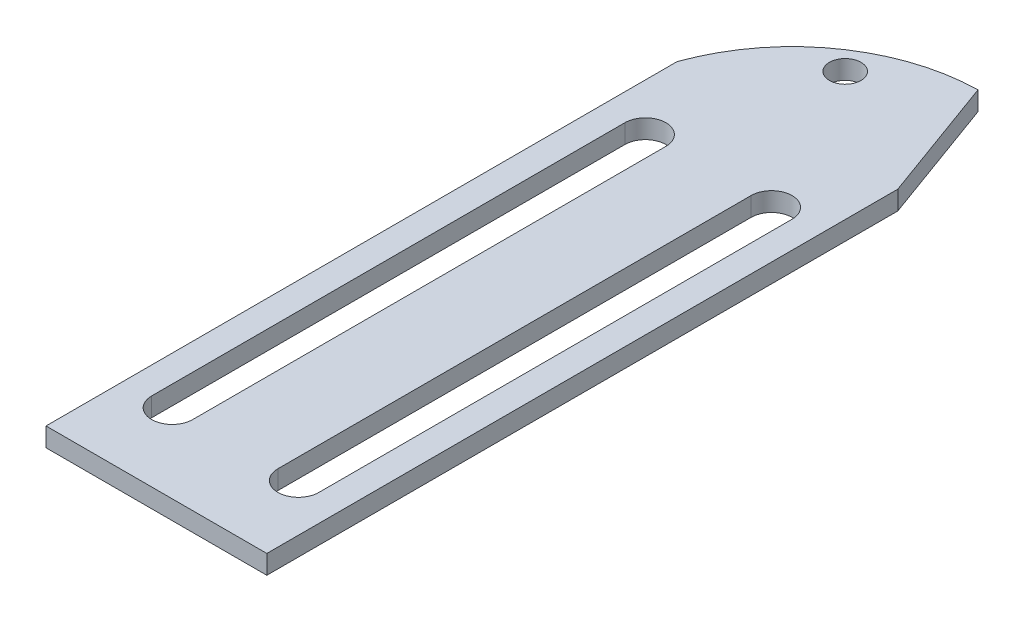
ISO-10303-21;
HEADER;
FILE_DESCRIPTION(('STEP AP214'),'2;1');
FILE_NAME('part.step','',(''),(''),'','','');
FILE_SCHEMA(('AUTOMOTIVE_DESIGN { 1 0 10303 214 1 1 1 1 }'));
ENDSEC;
DATA;
#1=APPLICATION_CONTEXT('core data for automotive mechanical design processes');
#2=APPLICATION_PROTOCOL_DEFINITION('international standard','automotive_design',2000,#1);
#3=PRODUCT_CONTEXT('',#1,'mechanical');
#4=PRODUCT('Part','Part','',(#3));
#5=PRODUCT_RELATED_PRODUCT_CATEGORY('part','',(#4));
#6=PRODUCT_DEFINITION_FORMATION('','',#4);
#7=PRODUCT_DEFINITION_CONTEXT('part definition',#1,'design');
#8=PRODUCT_DEFINITION('design','',#6,#7);
#9=PRODUCT_DEFINITION_SHAPE('','',#8);
#10=(LENGTH_UNIT() NAMED_UNIT(*) SI_UNIT(.MILLI.,.METRE.));
#11=(NAMED_UNIT(*) PLANE_ANGLE_UNIT() SI_UNIT($,.RADIAN.));
#12=(NAMED_UNIT(*) SI_UNIT($,.STERADIAN.) SOLID_ANGLE_UNIT());
#13=UNCERTAINTY_MEASURE_WITH_UNIT(LENGTH_MEASURE(1.E-05),#10,'distance_accuracy_value','');
#14=(GEOMETRIC_REPRESENTATION_CONTEXT(3) GLOBAL_UNCERTAINTY_ASSIGNED_CONTEXT((#13)) GLOBAL_UNIT_ASSIGNED_CONTEXT((#10,
#11,#12)) REPRESENTATION_CONTEXT('',''));
#15=CARTESIAN_POINT('',(0.,0.,0.));
#16=DIRECTION('',(0.,0.,1.));
#17=DIRECTION('',(1.,0.,0.));
#18=AXIS2_PLACEMENT_3D('',#15,#16,#17);
#19=CARTESIAN_POINT('',(17.5,3.,0.));
#20=DIRECTION('',(1.,0.,0.));
#21=DIRECTION('',(0.,0.,-1.));
#22=AXIS2_PLACEMENT_3D('',#19,#20,#21);
#23=PLANE('',#22);
#24=DIRECTION('',(0.,0.,1.));
#25=VECTOR('',#24,1.);
#26=CARTESIAN_POINT('',(17.5,0.,0.));
#27=LINE('',#26,#25);
#28=CARTESIAN_POINT('',(17.5,0.,-50.));
#29=VERTEX_POINT('',#28);
#30=CARTESIAN_POINT('',(17.5,0.,50.));
#31=VERTEX_POINT('',#30);
#32=EDGE_CURVE('E170',#29,#31,#27,.T.);
#33=ORIENTED_EDGE('',*,*,#32,.F.);
#34=DIRECTION('',(0.,-1.,0.));
#35=VECTOR('',#34,1.);
#36=CARTESIAN_POINT('',(17.5,3.,-50.));
#37=LINE('',#36,#35);
#38=CARTESIAN_POINT('',(17.5,3.,-50.));
#39=VERTEX_POINT('',#38);
#40=EDGE_CURVE('E236',#39,#29,#37,.T.);
#41=ORIENTED_EDGE('',*,*,#40,.F.);
#42=DIRECTION('',(0.,0.,1.));
#43=VECTOR('',#42,1.);
#44=CARTESIAN_POINT('',(17.5,3.,0.));
#45=LINE('',#44,#43);
#46=CARTESIAN_POINT('',(17.5,3.,50.));
#47=VERTEX_POINT('',#46);
#48=EDGE_CURVE('E204',#39,#47,#45,.T.);
#49=ORIENTED_EDGE('',*,*,#48,.T.);
#50=DIRECTION('',(0.,-1.,0.));
#51=VECTOR('',#50,1.);
#52=CARTESIAN_POINT('',(17.5,3.,50.));
#53=LINE('',#52,#51);
#54=EDGE_CURVE('E217',#47,#31,#53,.T.);
#55=ORIENTED_EDGE('',*,*,#54,.T.);
#56=EDGE_LOOP('',(#33,#41,#49,#55));
#57=FACE_BOUND('',#56,.T.);
#58=ADVANCED_FACE('F35',(#57),#23,.T.);
#59=CARTESIAN_POINT('',(31.5225791194544,3.,-11.4732805067825));
#60=DIRECTION('',(-0.93969262078591,0.,0.342020143325663));
#61=DIRECTION('',(0.342020143325663,0.,0.939692620785911));
#62=AXIS2_PLACEMENT_3D('',#59,#60,#61);
#63=PLANE('',#62);
#64=DIRECTION('',(-0.342020143325663,0.,-0.939692620785911));
#65=VECTOR('',#64,1.);
#66=CARTESIAN_POINT('',(31.5225791194544,0.,-11.4732805067825));
#67=LINE('',#66,#65);
#68=CARTESIAN_POINT('',(10.2225098197638,0.,-69.9947399405021));
#69=VERTEX_POINT('',#68);
#70=EDGE_CURVE('E220',#29,#69,#67,.T.);
#71=ORIENTED_EDGE('',*,*,#70,.T.);
#72=DIRECTION('',(0.,1.,0.));
#73=VECTOR('',#72,1.);
#74=CARTESIAN_POINT('',(10.2225098197638,1.5,-69.9947399405021));
#75=LINE('',#74,#73);
#76=CARTESIAN_POINT('',(10.2225098197638,3.,-69.9947399405021));
#77=VERTEX_POINT('',#76);
#78=EDGE_CURVE('E43',#69,#77,#75,.T.);
#79=ORIENTED_EDGE('',*,*,#78,.T.);
#80=DIRECTION('',(-0.342020143325663,0.,-0.939692620785911));
#81=VECTOR('',#80,1.);
#82=CARTESIAN_POINT('',(31.5225791194544,3.,-11.4732805067825));
#83=LINE('',#82,#81);
#84=EDGE_CURVE('E207',#39,#77,#83,.T.);
#85=ORIENTED_EDGE('',*,*,#84,.F.);
#86=ORIENTED_EDGE('',*,*,#40,.T.);
#87=EDGE_LOOP('',(#71,#79,#85,#86));
#88=FACE_BOUND('',#87,.T.);
#89=ADVANCED_FACE('F238',(#88),#63,.F.);
#90=CARTESIAN_POINT('',(-17.5,3.,0.));
#91=DIRECTION('',(1.,0.,0.));
#92=DIRECTION('',(0.,0.,-1.));
#93=AXIS2_PLACEMENT_3D('',#90,#91,#92);
#94=PLANE('',#93);
#95=DIRECTION('',(0.,0.,1.));
#96=VECTOR('',#95,1.);
#97=CARTESIAN_POINT('',(-17.5,0.,0.));
#98=LINE('',#97,#96);
#99=CARTESIAN_POINT('',(-17.5,0.,-50.));
#100=VERTEX_POINT('',#99);
#101=CARTESIAN_POINT('',(-17.5,0.,50.));
#102=VERTEX_POINT('',#101);
#103=EDGE_CURVE('E222',#100,#102,#98,.T.);
#104=ORIENTED_EDGE('',*,*,#103,.T.);
#105=DIRECTION('',(0.,-1.,0.));
#106=VECTOR('',#105,1.);
#107=CARTESIAN_POINT('',(-17.5,3.,50.));
#108=LINE('',#107,#106);
#109=CARTESIAN_POINT('',(-17.5,3.,50.));
#110=VERTEX_POINT('',#109);
#111=EDGE_CURVE('E230',#110,#102,#108,.T.);
#112=ORIENTED_EDGE('',*,*,#111,.F.);
#113=DIRECTION('',(0.,0.,1.));
#114=VECTOR('',#113,1.);
#115=CARTESIAN_POINT('',(-17.5,3.,0.));
#116=LINE('',#115,#114);
#117=CARTESIAN_POINT('',(-17.5,3.,-50.));
#118=VERTEX_POINT('',#117);
#119=EDGE_CURVE('E210',#118,#110,#116,.T.);
#120=ORIENTED_EDGE('',*,*,#119,.F.);
#121=DIRECTION('',(0.,-1.,0.));
#122=VECTOR('',#121,1.);
#123=CARTESIAN_POINT('',(-17.5,3.,-50.));
#124=LINE('',#123,#122);
#125=EDGE_CURVE('E233',#118,#100,#124,.T.);
#126=ORIENTED_EDGE('',*,*,#125,.T.);
#127=EDGE_LOOP('',(#104,#112,#120,#126));
#128=FACE_BOUND('',#127,.T.);
#129=ADVANCED_FACE('F250',(#128),#94,.F.);
#130=CARTESIAN_POINT('',(0.,3.,50.));
#131=DIRECTION('',(0.,0.,-1.));
#132=DIRECTION('',(-1.,0.,0.));
#133=AXIS2_PLACEMENT_3D('',#130,#131,#132);
#134=PLANE('',#133);
#135=DIRECTION('',(1.,0.,0.));
#136=VECTOR('',#135,1.);
#137=CARTESIAN_POINT('',(0.,0.,50.));
#138=LINE('',#137,#136);
#139=EDGE_CURVE('E224',#102,#31,#138,.T.);
#140=ORIENTED_EDGE('',*,*,#139,.T.);
#141=ORIENTED_EDGE('',*,*,#54,.F.);
#142=DIRECTION('',(1.,0.,0.));
#143=VECTOR('',#142,1.);
#144=CARTESIAN_POINT('',(0.,3.,50.));
#145=LINE('',#144,#143);
#146=EDGE_CURVE('E212',#110,#47,#145,.T.);
#147=ORIENTED_EDGE('',*,*,#146,.F.);
#148=ORIENTED_EDGE('',*,*,#111,.T.);
#149=EDGE_LOOP('',(#140,#141,#147,#148));
#150=FACE_BOUND('',#149,.T.);
#151=ADVANCED_FACE('F247',(#150),#134,.F.);
#152=CARTESIAN_POINT('',(-2.83030939833299,3.,-62.));
#153=DIRECTION('',(0.,-1.,0.));
#154=DIRECTION('',(0.,0.,-1.));
#155=AXIS2_PLACEMENT_3D('',#152,#153,#154);
#156=CYLINDRICAL_SURFACE('',#155,2.5);
#157=CARTESIAN_POINT('',(-2.83030939833299,3.,-62.));
#158=DIRECTION('',(0.,1.,0.));
#159=DIRECTION('',(0.,0.,1.));
#160=AXIS2_PLACEMENT_3D('',#157,#158,#159);
#161=CIRCLE('',#160,2.5);
#162=CARTESIAN_POINT('',(-2.83030939833299,3.,-59.5));
#163=VERTEX_POINT('',#162);
#164=EDGE_CURVE('E214',#163,#163,#161,.T.);
#165=ORIENTED_EDGE('',*,*,#164,.T.);
#166=EDGE_LOOP('',(#165));
#167=FACE_BOUND('',#166,.T.);
#168=CARTESIAN_POINT('',(-2.83030939833299,0.,-62.));
#169=DIRECTION('',(0.,1.,0.));
#170=DIRECTION('',(0.,0.,1.));
#171=AXIS2_PLACEMENT_3D('',#168,#169,#170);
#172=CIRCLE('',#171,2.5);
#173=CARTESIAN_POINT('',(-2.83030939833299,0.,-59.5));
#174=VERTEX_POINT('',#173);
#175=EDGE_CURVE('E208',#174,#174,#172,.T.);
#176=ORIENTED_EDGE('',*,*,#175,.F.);
#177=EDGE_LOOP('',(#176));
#178=FACE_BOUND('',#177,.T.);
#179=ADVANCED_FACE('F259',(#167,#178),#156,.F.);
#180=CARTESIAN_POINT('',(0.,3.,0.));
#181=DIRECTION('',(0.,1.,0.));
#182=DIRECTION('',(0.,0.,1.));
#183=AXIS2_PLACEMENT_3D('',#180,#181,#182);
#184=PLANE('',#183);
#185=CARTESIAN_POINT('',(-10.,3.,37.5));
#186=DIRECTION('',(0.,1.,0.));
#187=DIRECTION('',(0.,0.,1.));
#188=AXIS2_PLACEMENT_3D('',#185,#186,#187);
#189=CIRCLE('',#188,3.25);
#190=CARTESIAN_POINT('',(-13.25,3.,37.5));
#191=VERTEX_POINT('',#190);
#192=CARTESIAN_POINT('',(-6.75,3.,37.5));
#193=VERTEX_POINT('',#192);
#194=EDGE_CURVE('E137',#191,#193,#189,.T.);
#195=ORIENTED_EDGE('',*,*,#194,.F.);
#196=DIRECTION('',(0.,0.,-1.));
#197=VECTOR('',#196,1.);
#198=CARTESIAN_POINT('',(-13.25,3.,37.5));
#199=LINE('',#198,#197);
#200=CARTESIAN_POINT('',(-13.25,3.,-37.5));
#201=VERTEX_POINT('',#200);
#202=EDGE_CURVE('E154',#191,#201,#199,.T.);
#203=ORIENTED_EDGE('',*,*,#202,.T.);
#204=CARTESIAN_POINT('',(-10.,3.,-37.5));
#205=DIRECTION('',(0.,1.,0.));
#206=DIRECTION('',(0.,0.,1.));
#207=AXIS2_PLACEMENT_3D('',#204,#205,#206);
#208=CIRCLE('',#207,3.25);
#209=CARTESIAN_POINT('',(-6.75000000000002,3.,-37.5));
#210=VERTEX_POINT('',#209);
#211=EDGE_CURVE('E157',#210,#201,#208,.T.);
#212=ORIENTED_EDGE('',*,*,#211,.F.);
#213=DIRECTION('',(0.,0.,-1.));
#214=VECTOR('',#213,1.);
#215=CARTESIAN_POINT('',(-6.75,3.,37.5));
#216=LINE('',#215,#214);
#217=EDGE_CURVE('E163',#193,#210,#216,.T.);
#218=ORIENTED_EDGE('',*,*,#217,.F.);
#219=EDGE_LOOP('',(#195,#203,#212,#218));
#220=FACE_BOUND('',#219,.T.);
#221=CARTESIAN_POINT('',(10.,3.,37.5));
#222=DIRECTION('',(0.,1.,0.));
#223=DIRECTION('',(0.,0.,1.));
#224=AXIS2_PLACEMENT_3D('',#221,#222,#223);
#225=CIRCLE('',#224,3.25);
#226=CARTESIAN_POINT('',(6.75000000000002,3.,37.5));
#227=VERTEX_POINT('',#226);
#228=CARTESIAN_POINT('',(13.25,3.,37.5));
#229=VERTEX_POINT('',#228);
#230=EDGE_CURVE('E164',#227,#229,#225,.T.);
#231=ORIENTED_EDGE('',*,*,#230,.F.);
#232=DIRECTION('',(0.,0.,-1.));
#233=VECTOR('',#232,1.);
#234=CARTESIAN_POINT('',(6.75000000000002,3.,37.5));
#235=LINE('',#234,#233);
#236=CARTESIAN_POINT('',(6.75,3.,-37.5));
#237=VERTEX_POINT('',#236);
#238=EDGE_CURVE('E184',#227,#237,#235,.T.);
#239=ORIENTED_EDGE('',*,*,#238,.T.);
#240=CARTESIAN_POINT('',(10.,3.,-37.5));
#241=DIRECTION('',(0.,1.,0.));
#242=DIRECTION('',(0.,0.,1.));
#243=AXIS2_PLACEMENT_3D('',#240,#241,#242);
#244=CIRCLE('',#243,3.25);
#245=CARTESIAN_POINT('',(13.25,3.,-37.5));
#246=VERTEX_POINT('',#245);
#247=EDGE_CURVE('E187',#246,#237,#244,.T.);
#248=ORIENTED_EDGE('',*,*,#247,.F.);
#249=DIRECTION('',(0.,0.,-1.));
#250=VECTOR('',#249,1.);
#251=CARTESIAN_POINT('',(13.25,3.,37.5));
#252=LINE('',#251,#250);
#253=EDGE_CURVE('E191',#229,#246,#252,.T.);
#254=ORIENTED_EDGE('',*,*,#253,.F.);
#255=EDGE_LOOP('',(#231,#239,#248,#254));
#256=FACE_BOUND('',#255,.T.);
#257=ORIENTED_EDGE('',*,*,#84,.T.);
#258=CARTESIAN_POINT('',(10.7842712474619,3.,-40.));
#259=DIRECTION('',(0.,1.,0.));
#260=DIRECTION('',(0.,0.,1.));
#261=AXIS2_PLACEMENT_3D('',#258,#259,#260);
#262=CIRCLE('',#261,30.);
#263=EDGE_CURVE('E11',#77,#118,#262,.T.);
#264=ORIENTED_EDGE('',*,*,#263,.T.);
#265=ORIENTED_EDGE('',*,*,#119,.T.);
#266=ORIENTED_EDGE('',*,*,#146,.T.);
#267=ORIENTED_EDGE('',*,*,#48,.F.);
#268=EDGE_LOOP('',(#257,#264,#265,#266,#267));
#269=FACE_BOUND('',#268,.T.);
#270=ORIENTED_EDGE('',*,*,#164,.F.);
#271=EDGE_LOOP('',(#270));
#272=FACE_BOUND('',#271,.T.);
#273=ADVANCED_FACE('F256',(#220,#256,#269,#272),#184,.T.);
#274=CARTESIAN_POINT('',(0.,0.,0.));
#275=DIRECTION('',(0.,1.,0.));
#276=DIRECTION('',(0.,0.,1.));
#277=AXIS2_PLACEMENT_3D('',#274,#275,#276);
#278=PLANE('',#277);
#279=DIRECTION('',(0.,0.,-1.));
#280=VECTOR('',#279,1.);
#281=CARTESIAN_POINT('',(-13.25,0.,37.5));
#282=LINE('',#281,#280);
#283=CARTESIAN_POINT('',(-13.25,0.,37.5));
#284=VERTEX_POINT('',#283);
#285=CARTESIAN_POINT('',(-13.25,0.,-37.5));
#286=VERTEX_POINT('',#285);
#287=EDGE_CURVE('E142',#284,#286,#282,.T.);
#288=ORIENTED_EDGE('',*,*,#287,.F.);
#289=CARTESIAN_POINT('',(-10.,0.,37.5));
#290=DIRECTION('',(0.,1.,0.));
#291=DIRECTION('',(0.,0.,1.));
#292=AXIS2_PLACEMENT_3D('',#289,#290,#291);
#293=CIRCLE('',#292,3.25);
#294=CARTESIAN_POINT('',(-6.75,0.,37.5));
#295=VERTEX_POINT('',#294);
#296=EDGE_CURVE('E134',#284,#295,#293,.T.);
#297=ORIENTED_EDGE('',*,*,#296,.T.);
#298=DIRECTION('',(0.,0.,-1.));
#299=VECTOR('',#298,1.);
#300=CARTESIAN_POINT('',(-6.75,0.,37.5));
#301=LINE('',#300,#299);
#302=CARTESIAN_POINT('',(-6.75000000000002,0.,-37.5));
#303=VERTEX_POINT('',#302);
#304=EDGE_CURVE('E146',#295,#303,#301,.T.);
#305=ORIENTED_EDGE('',*,*,#304,.T.);
#306=CARTESIAN_POINT('',(-10.,0.,-37.5));
#307=DIRECTION('',(0.,1.,0.));
#308=DIRECTION('',(0.,0.,1.));
#309=AXIS2_PLACEMENT_3D('',#306,#307,#308);
#310=CIRCLE('',#309,3.25);
#311=EDGE_CURVE('E150',#303,#286,#310,.T.);
#312=ORIENTED_EDGE('',*,*,#311,.T.);
#313=EDGE_LOOP('',(#288,#297,#305,#312));
#314=FACE_BOUND('',#313,.T.);
#315=DIRECTION('',(0.,0.,-1.));
#316=VECTOR('',#315,1.);
#317=CARTESIAN_POINT('',(6.75000000000002,0.,37.5));
#318=LINE('',#317,#316);
#319=CARTESIAN_POINT('',(6.75000000000002,0.,37.5));
#320=VERTEX_POINT('',#319);
#321=CARTESIAN_POINT('',(6.75,0.,-37.5));
#322=VERTEX_POINT('',#321);
#323=EDGE_CURVE('E177',#320,#322,#318,.T.);
#324=ORIENTED_EDGE('',*,*,#323,.F.);
#325=CARTESIAN_POINT('',(10.,0.,37.5));
#326=DIRECTION('',(0.,1.,0.));
#327=DIRECTION('',(0.,0.,1.));
#328=AXIS2_PLACEMENT_3D('',#325,#326,#327);
#329=CIRCLE('',#328,3.25);
#330=CARTESIAN_POINT('',(13.25,0.,37.5));
#331=VERTEX_POINT('',#330);
#332=EDGE_CURVE('E188',#320,#331,#329,.T.);
#333=ORIENTED_EDGE('',*,*,#332,.T.);
#334=DIRECTION('',(0.,0.,-1.));
#335=VECTOR('',#334,1.);
#336=CARTESIAN_POINT('',(13.25,0.,37.5));
#337=LINE('',#336,#335);
#338=CARTESIAN_POINT('',(13.25,0.,-37.5));
#339=VERTEX_POINT('',#338);
#340=EDGE_CURVE('E199',#331,#339,#337,.T.);
#341=ORIENTED_EDGE('',*,*,#340,.T.);
#342=CARTESIAN_POINT('',(10.,0.,-37.5));
#343=DIRECTION('',(0.,1.,0.));
#344=DIRECTION('',(0.,0.,1.));
#345=AXIS2_PLACEMENT_3D('',#342,#343,#344);
#346=CIRCLE('',#345,3.25);
#347=EDGE_CURVE('E196',#339,#322,#346,.T.);
#348=ORIENTED_EDGE('',*,*,#347,.T.);
#349=EDGE_LOOP('',(#324,#333,#341,#348));
#350=FACE_BOUND('',#349,.T.);
#351=ORIENTED_EDGE('',*,*,#103,.F.);
#352=CARTESIAN_POINT('',(10.7842712474619,0.,-40.));
#353=DIRECTION('',(0.,1.,0.));
#354=DIRECTION('',(0.,0.,1.));
#355=AXIS2_PLACEMENT_3D('',#352,#353,#354);
#356=CIRCLE('',#355,30.);
#357=EDGE_CURVE('E57',#100,#69,#356,.F.);
#358=ORIENTED_EDGE('',*,*,#357,.T.);
#359=ORIENTED_EDGE('',*,*,#70,.F.);
#360=ORIENTED_EDGE('',*,*,#32,.T.);
#361=ORIENTED_EDGE('',*,*,#139,.F.);
#362=EDGE_LOOP('',(#351,#358,#359,#360,#361));
#363=FACE_BOUND('',#362,.T.);
#364=ORIENTED_EDGE('',*,*,#175,.T.);
#365=EDGE_LOOP('',(#364));
#366=FACE_BOUND('',#365,.T.);
#367=ADVANCED_FACE('F152',(#314,#350,#363,#366),#278,.F.);
#368=CARTESIAN_POINT('',(10.,0.,37.5));
#369=DIRECTION('',(0.,1.,0.));
#370=DIRECTION('',(0.,0.,1.));
#371=AXIS2_PLACEMENT_3D('',#368,#369,#370);
#372=CYLINDRICAL_SURFACE('',#371,3.25);
#373=ORIENTED_EDGE('',*,*,#230,.T.);
#374=DIRECTION('',(0.,1.,0.));
#375=VECTOR('',#374,1.);
#376=CARTESIAN_POINT('',(13.25,0.,37.5));
#377=LINE('',#376,#375);
#378=EDGE_CURVE('E174',#331,#229,#377,.T.);
#379=ORIENTED_EDGE('',*,*,#378,.F.);
#380=ORIENTED_EDGE('',*,*,#332,.F.);
#381=DIRECTION('',(0.,1.,0.));
#382=VECTOR('',#381,1.);
#383=CARTESIAN_POINT('',(6.75000000000002,0.,37.5));
#384=LINE('',#383,#382);
#385=EDGE_CURVE('E182',#320,#227,#384,.T.);
#386=ORIENTED_EDGE('',*,*,#385,.T.);
#387=EDGE_LOOP('',(#373,#379,#380,#386));
#388=FACE_BOUND('',#387,.T.);
#389=ADVANCED_FACE('F269',(#388),#372,.F.);
#390=CARTESIAN_POINT('',(6.75000000000002,0.,37.5));
#391=DIRECTION('',(1.,0.,0.));
#392=DIRECTION('',(0.,0.,-1.));
#393=AXIS2_PLACEMENT_3D('',#390,#391,#392);
#394=PLANE('',#393);
#395=ORIENTED_EDGE('',*,*,#238,.F.);
#396=ORIENTED_EDGE('',*,*,#385,.F.);
#397=ORIENTED_EDGE('',*,*,#323,.T.);
#398=DIRECTION('',(0.,1.,0.));
#399=VECTOR('',#398,1.);
#400=CARTESIAN_POINT('',(6.75,0.,-37.5));
#401=LINE('',#400,#399);
#402=EDGE_CURVE('E180',#322,#237,#401,.T.);
#403=ORIENTED_EDGE('',*,*,#402,.T.);
#404=EDGE_LOOP('',(#395,#396,#397,#403));
#405=FACE_BOUND('',#404,.T.);
#406=ADVANCED_FACE('F275',(#405),#394,.T.);
#407=CARTESIAN_POINT('',(10.,0.,-37.5));
#408=DIRECTION('',(0.,1.,0.));
#409=DIRECTION('',(0.,0.,1.));
#410=AXIS2_PLACEMENT_3D('',#407,#408,#409);
#411=CYLINDRICAL_SURFACE('',#410,3.25);
#412=ORIENTED_EDGE('',*,*,#247,.T.);
#413=ORIENTED_EDGE('',*,*,#402,.F.);
#414=ORIENTED_EDGE('',*,*,#347,.F.);
#415=DIRECTION('',(0.,1.,0.));
#416=VECTOR('',#415,1.);
#417=CARTESIAN_POINT('',(13.25,0.,-37.5));
#418=LINE('',#417,#416);
#419=EDGE_CURVE('E178',#339,#246,#418,.T.);
#420=ORIENTED_EDGE('',*,*,#419,.T.);
#421=EDGE_LOOP('',(#412,#413,#414,#420));
#422=FACE_BOUND('',#421,.T.);
#423=ADVANCED_FACE('F319',(#422),#411,.F.);
#424=CARTESIAN_POINT('',(13.25,0.,37.5));
#425=DIRECTION('',(1.,0.,0.));
#426=DIRECTION('',(0.,0.,-1.));
#427=AXIS2_PLACEMENT_3D('',#424,#425,#426);
#428=PLANE('',#427);
#429=ORIENTED_EDGE('',*,*,#253,.T.);
#430=ORIENTED_EDGE('',*,*,#419,.F.);
#431=ORIENTED_EDGE('',*,*,#340,.F.);
#432=ORIENTED_EDGE('',*,*,#378,.T.);
#433=EDGE_LOOP('',(#429,#430,#431,#432));
#434=FACE_BOUND('',#433,.T.);
#435=ADVANCED_FACE('F327',(#434),#428,.F.);
#436=CARTESIAN_POINT('',(-10.,0.,37.5));
#437=DIRECTION('',(0.,1.,0.));
#438=DIRECTION('',(0.,0.,1.));
#439=AXIS2_PLACEMENT_3D('',#436,#437,#438);
#440=CYLINDRICAL_SURFACE('',#439,3.25);
#441=ORIENTED_EDGE('',*,*,#194,.T.);
#442=DIRECTION('',(0.,1.,0.));
#443=VECTOR('',#442,1.);
#444=CARTESIAN_POINT('',(-6.75,0.,37.5));
#445=LINE('',#444,#443);
#446=EDGE_CURVE('E130',#295,#193,#445,.T.);
#447=ORIENTED_EDGE('',*,*,#446,.F.);
#448=ORIENTED_EDGE('',*,*,#296,.F.);
#449=DIRECTION('',(0.,1.,0.));
#450=VECTOR('',#449,1.);
#451=CARTESIAN_POINT('',(-13.25,0.,37.5));
#452=LINE('',#451,#450);
#453=EDGE_CURVE('E168',#284,#191,#452,.T.);
#454=ORIENTED_EDGE('',*,*,#453,.T.);
#455=EDGE_LOOP('',(#441,#447,#448,#454));
#456=FACE_BOUND('',#455,.T.);
#457=ADVANCED_FACE('F132',(#456),#440,.F.);
#458=CARTESIAN_POINT('',(-13.25,0.,37.5));
#459=DIRECTION('',(1.,0.,0.));
#460=DIRECTION('',(0.,0.,-1.));
#461=AXIS2_PLACEMENT_3D('',#458,#459,#460);
#462=PLANE('',#461);
#463=ORIENTED_EDGE('',*,*,#202,.F.);
#464=ORIENTED_EDGE('',*,*,#453,.F.);
#465=ORIENTED_EDGE('',*,*,#287,.T.);
#466=DIRECTION('',(0.,1.,0.));
#467=VECTOR('',#466,1.);
#468=CARTESIAN_POINT('',(-13.25,0.,-37.5));
#469=LINE('',#468,#467);
#470=EDGE_CURVE('E171',#286,#201,#469,.T.);
#471=ORIENTED_EDGE('',*,*,#470,.T.);
#472=EDGE_LOOP('',(#463,#464,#465,#471));
#473=FACE_BOUND('',#472,.T.);
#474=ADVANCED_FACE('F342',(#473),#462,.T.);
#475=CARTESIAN_POINT('',(-10.,0.,-37.5));
#476=DIRECTION('',(0.,1.,0.));
#477=DIRECTION('',(0.,0.,1.));
#478=AXIS2_PLACEMENT_3D('',#475,#476,#477);
#479=CYLINDRICAL_SURFACE('',#478,3.25);
#480=ORIENTED_EDGE('',*,*,#211,.T.);
#481=ORIENTED_EDGE('',*,*,#470,.F.);
#482=ORIENTED_EDGE('',*,*,#311,.F.);
#483=DIRECTION('',(0.,1.,0.));
#484=VECTOR('',#483,1.);
#485=CARTESIAN_POINT('',(-6.75000000000002,0.,-37.5));
#486=LINE('',#485,#484);
#487=EDGE_CURVE('E141',#303,#210,#486,.T.);
#488=ORIENTED_EDGE('',*,*,#487,.T.);
#489=EDGE_LOOP('',(#480,#481,#482,#488));
#490=FACE_BOUND('',#489,.T.);
#491=ADVANCED_FACE('F349',(#490),#479,.F.);
#492=CARTESIAN_POINT('',(-6.75,0.,37.5));
#493=DIRECTION('',(1.,0.,0.));
#494=DIRECTION('',(0.,0.,-1.));
#495=AXIS2_PLACEMENT_3D('',#492,#493,#494);
#496=PLANE('',#495);
#497=ORIENTED_EDGE('',*,*,#217,.T.);
#498=ORIENTED_EDGE('',*,*,#487,.F.);
#499=ORIENTED_EDGE('',*,*,#304,.F.);
#500=ORIENTED_EDGE('',*,*,#446,.T.);
#501=EDGE_LOOP('',(#497,#498,#499,#500));
#502=FACE_BOUND('',#501,.T.);
#503=ADVANCED_FACE('F147',(#502),#496,.F.);
#504=CARTESIAN_POINT('',(10.7842712474619,3.,-40.));
#505=DIRECTION('',(0.,1.,0.));
#506=DIRECTION('',(0.,0.,1.));
#507=AXIS2_PLACEMENT_3D('',#504,#505,#506);
#508=CYLINDRICAL_SURFACE('',#507,30.);
#509=ORIENTED_EDGE('',*,*,#263,.F.);
#510=ORIENTED_EDGE('',*,*,#78,.F.);
#511=ORIENTED_EDGE('',*,*,#357,.F.);
#512=ORIENTED_EDGE('',*,*,#125,.F.);
#513=EDGE_LOOP('',(#509,#510,#511,#512));
#514=FACE_BOUND('',#513,.T.);
#515=ADVANCED_FACE('F37',(#514),#508,.T.);
#516=CLOSED_SHELL('',(#58,#89,#129,#151,#179,#273,#367,#389,#406,#423,#435,#457,#474,#491,#503,#515));
#517=MANIFOLD_SOLID_BREP('B2',#516);
#518=ADVANCED_BREP_SHAPE_REPRESENTATION('',(#18,#517),#14);
#519=SHAPE_DEFINITION_REPRESENTATION(#9,#518);
ENDSEC;
END-ISO-10303-21;
